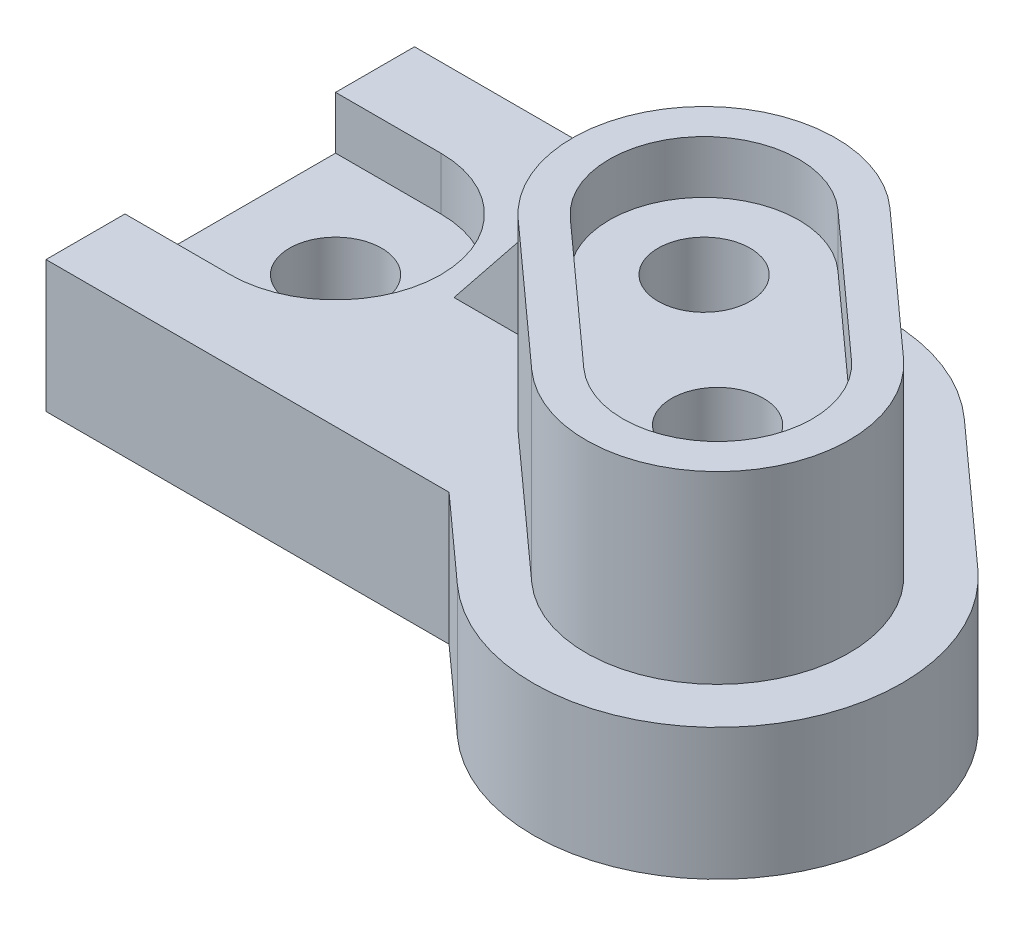
ISO-10303-21;
HEADER;
FILE_DESCRIPTION(('STEP AP214'),'2;1');
FILE_NAME('part.step','',(''),(''),'','','');
FILE_SCHEMA(('AUTOMOTIVE_DESIGN { 1 0 10303 214 1 1 1 1 }'));
ENDSEC;
DATA;
#1=APPLICATION_CONTEXT('core data for automotive mechanical design processes');
#2=APPLICATION_PROTOCOL_DEFINITION('international standard','automotive_design',2000,#1);
#3=PRODUCT_CONTEXT('',#1,'mechanical');
#4=PRODUCT('Part','Part','',(#3));
#5=PRODUCT_RELATED_PRODUCT_CATEGORY('part','',(#4));
#6=PRODUCT_DEFINITION_FORMATION('','',#4);
#7=PRODUCT_DEFINITION_CONTEXT('part definition',#1,'design');
#8=PRODUCT_DEFINITION('design','',#6,#7);
#9=PRODUCT_DEFINITION_SHAPE('','',#8);
#10=(LENGTH_UNIT() NAMED_UNIT(*) SI_UNIT(.MILLI.,.METRE.));
#11=(NAMED_UNIT(*) PLANE_ANGLE_UNIT() SI_UNIT($,.RADIAN.));
#12=(NAMED_UNIT(*) SI_UNIT($,.STERADIAN.) SOLID_ANGLE_UNIT());
#13=UNCERTAINTY_MEASURE_WITH_UNIT(LENGTH_MEASURE(1.E-05),#10,'distance_accuracy_value','');
#14=(GEOMETRIC_REPRESENTATION_CONTEXT(3) GLOBAL_UNCERTAINTY_ASSIGNED_CONTEXT((#13)) GLOBAL_UNIT_ASSIGNED_CONTEXT((#10,
#11,#12)) REPRESENTATION_CONTEXT('',''));
#15=CARTESIAN_POINT('',(0.,0.,0.));
#16=DIRECTION('',(0.,0.,1.));
#17=DIRECTION('',(1.,0.,0.));
#18=AXIS2_PLACEMENT_3D('',#15,#16,#17);
#19=CARTESIAN_POINT('',(0.,50.,-32.4999999999999));
#20=DIRECTION('',(0.,0.,-1.));
#21=DIRECTION('',(-1.,0.,0.));
#22=AXIS2_PLACEMENT_3D('',#19,#20,#21);
#23=PLANE('',#22);
#24=DIRECTION('',(0.,-1.,0.));
#25=VECTOR('',#24,1.);
#26=CARTESIAN_POINT('',(65.,50.,-32.4999999999999));
#27=LINE('',#26,#25);
#28=CARTESIAN_POINT('',(65.,50.,-32.4999999999999));
#29=VERTEX_POINT('',#28);
#30=CARTESIAN_POINT('',(65.,25.,-32.4999999999999));
#31=VERTEX_POINT('',#30);
#32=EDGE_CURVE('E89',#29,#31,#27,.T.);
#33=ORIENTED_EDGE('',*,*,#32,.F.);
#34=DIRECTION('',(0.624695047554424,0.78086880944303,0.));
#35=VECTOR('',#34,1.);
#36=CARTESIAN_POINT('',(45.,25.,-32.4999999999999));
#37=LINE('',#36,#35);
#38=CARTESIAN_POINT('',(45.,25.,-32.4999999999999));
#39=VERTEX_POINT('',#38);
#40=EDGE_CURVE('E14',#29,#39,#37,.F.);
#41=ORIENTED_EDGE('',*,*,#40,.T.);
#42=DIRECTION('',(1.,0.,0.));
#43=VECTOR('',#42,1.);
#44=CARTESIAN_POINT('',(0.,25.,-32.4999999999999));
#45=LINE('',#44,#43);
#46=EDGE_CURVE('E87',#39,#31,#45,.T.);
#47=ORIENTED_EDGE('',*,*,#46,.T.);
#48=EDGE_LOOP('',(#33,#41,#47));
#49=FACE_BOUND('',#48,.T.);
#50=ADVANCED_FACE('F53',(#49),#23,.F.);
#51=CARTESIAN_POINT('',(64.9999999999999,50.,1.80411241501588E-13));
#52=DIRECTION('',(-1.,0.,0.));
#53=DIRECTION('',(0.,0.,1.));
#54=AXIS2_PLACEMENT_3D('',#51,#52,#53);
#55=PLANE('',#54);
#56=DIRECTION('',(0.,0.,-1.));
#57=VECTOR('',#56,1.);
#58=CARTESIAN_POINT('',(64.9999999999999,25.,1.80411241501588E-13));
#59=LINE('',#58,#57);
#60=CARTESIAN_POINT('',(65.,25.,-37.4999999999999));
#61=VERTEX_POINT('',#60);
#62=EDGE_CURVE('E96',#31,#61,#59,.T.);
#63=ORIENTED_EDGE('',*,*,#62,.T.);
#64=DIRECTION('',(0.,-1.,0.));
#65=VECTOR('',#64,1.);
#66=CARTESIAN_POINT('',(65.,50.,-37.4999999999999));
#67=LINE('',#66,#65);
#68=CARTESIAN_POINT('',(65.,50.,-37.4999999999999));
#69=VERTEX_POINT('',#68);
#70=EDGE_CURVE('E101',#69,#61,#67,.T.);
#71=ORIENTED_EDGE('',*,*,#70,.F.);
#72=DIRECTION('',(0.,0.,-1.));
#73=VECTOR('',#72,1.);
#74=CARTESIAN_POINT('',(64.9999999999999,50.,1.80411241501588E-13));
#75=LINE('',#74,#73);
#76=EDGE_CURVE('E98',#29,#69,#75,.T.);
#77=ORIENTED_EDGE('',*,*,#76,.F.);
#78=ORIENTED_EDGE('',*,*,#32,.T.);
#79=EDGE_LOOP('',(#63,#71,#77,#78));
#80=FACE_BOUND('',#79,.T.);
#81=ADVANCED_FACE('F108',(#80),#55,.F.);
#82=CARTESIAN_POINT('',(0.,50.,-37.4999999999999));
#83=DIRECTION('',(0.,0.,-1.));
#84=DIRECTION('',(-1.,0.,0.));
#85=AXIS2_PLACEMENT_3D('',#82,#83,#84);
#86=PLANE('',#85);
#87=DIRECTION('',(1.,0.,0.));
#88=VECTOR('',#87,1.);
#89=CARTESIAN_POINT('',(0.,25.,-37.4999999999999));
#90=LINE('',#89,#88);
#91=CARTESIAN_POINT('',(45.,25.,-37.4999999999999));
#92=VERTEX_POINT('',#91);
#93=EDGE_CURVE('E99',#92,#61,#90,.T.);
#94=ORIENTED_EDGE('',*,*,#93,.F.);
#95=DIRECTION('',(-0.624695047554424,-0.78086880944303,0.));
#96=VECTOR('',#95,1.);
#97=CARTESIAN_POINT('',(39.6341463414634,18.2926829268293,-37.4999999999999));
#98=LINE('',#97,#96);
#99=EDGE_CURVE('E62',#92,#69,#98,.F.);
#100=ORIENTED_EDGE('',*,*,#99,.T.);
#101=ORIENTED_EDGE('',*,*,#70,.T.);
#102=EDGE_LOOP('',(#94,#100,#101));
#103=FACE_BOUND('',#102,.T.);
#104=ADVANCED_FACE('F109',(#103),#86,.T.);
#105=CARTESIAN_POINT('',(0.,25.,0.));
#106=DIRECTION('',(0.,1.,0.));
#107=DIRECTION('',(0.,0.,1.));
#108=AXIS2_PLACEMENT_3D('',#105,#106,#107);
#109=PLANE('',#108);
#110=ORIENTED_EDGE('',*,*,#46,.F.);
#111=DIRECTION('',(0.,0.,-1.));
#112=VECTOR('',#111,1.);
#113=CARTESIAN_POINT('',(45.,25.,0.));
#114=LINE('',#113,#112);
#115=EDGE_CURVE('E94',#39,#92,#114,.T.);
#116=ORIENTED_EDGE('',*,*,#115,.T.);
#117=ORIENTED_EDGE('',*,*,#93,.T.);
#118=ORIENTED_EDGE('',*,*,#62,.F.);
#119=EDGE_LOOP('',(#110,#116,#117,#118));
#120=FACE_BOUND('',#119,.T.);
#121=ADVANCED_FACE('F92',(#120),#109,.F.);
#122=CARTESIAN_POINT('',(45.,25.,0.));
#123=DIRECTION('',(0.78086880944303,-0.624695047554424,0.));
#124=DIRECTION('',(0.,0.,-1.));
#125=AXIS2_PLACEMENT_3D('',#122,#123,#124);
#126=PLANE('',#125);
#127=ORIENTED_EDGE('',*,*,#40,.F.);
#128=ORIENTED_EDGE('',*,*,#76,.T.);
#129=ORIENTED_EDGE('',*,*,#99,.F.);
#130=ORIENTED_EDGE('',*,*,#115,.F.);
#131=EDGE_LOOP('',(#127,#128,#129,#130));
#132=FACE_BOUND('',#131,.T.);
#133=ADVANCED_FACE('F55',(#132),#126,.F.);
#134=CLOSED_SHELL('',(#50,#81,#104,#121,#133));
#135=MANIFOLD_SOLID_BREP('B2',#134);
#136=CARTESIAN_POINT('',(20.,25.,-35.));
#137=DIRECTION('',(0.,1.,0.));
#138=DIRECTION('',(0.,0.,1.));
#139=AXIS2_PLACEMENT_3D('',#136,#137,#138);
#140=CYLINDRICAL_SURFACE('',#139,8.74999999999999);
#141=CARTESIAN_POINT('',(20.,0.,-35.));
#142=DIRECTION('',(0.,1.,0.));
#143=DIRECTION('',(0.,0.,1.));
#144=AXIS2_PLACEMENT_3D('',#141,#142,#143);
#145=CIRCLE('',#144,8.74999999999999);
#146=CARTESIAN_POINT('',(20.,0.,-26.25));
#147=VERTEX_POINT('',#146);
#148=EDGE_CURVE('E157',#147,#147,#145,.T.);
#149=ORIENTED_EDGE('',*,*,#148,.F.);
#150=EDGE_LOOP('',(#149));
#151=FACE_BOUND('',#150,.T.);
#152=CARTESIAN_POINT('',(20.,15.,-35.));
#153=DIRECTION('',(0.,1.,0.));
#154=DIRECTION('',(0.,0.,1.));
#155=AXIS2_PLACEMENT_3D('',#152,#153,#154);
#156=CIRCLE('',#155,8.74999999999999);
#157=CARTESIAN_POINT('',(20.,15.,-26.25));
#158=VERTEX_POINT('',#157);
#159=EDGE_CURVE('E304',#158,#158,#156,.F.);
#160=ORIENTED_EDGE('',*,*,#159,.F.);
#161=EDGE_LOOP('',(#160));
#162=FACE_BOUND('',#161,.T.);
#163=ADVANCED_FACE('F153',(#151,#162),#140,.F.);
#164=CARTESIAN_POINT('',(0.,25.,0.));
#165=DIRECTION('',(0.,1.,0.));
#166=DIRECTION('',(0.,0.,1.));
#167=AXIS2_PLACEMENT_3D('',#164,#165,#166);
#168=PLANE('',#167);
#169=DIRECTION('',(1.,0.,0.));
#170=VECTOR('',#169,1.);
#171=CARTESIAN_POINT('',(0.,25.,-15.));
#172=LINE('',#171,#170);
#173=CARTESIAN_POINT('',(0.,25.,-15.));
#174=VERTEX_POINT('',#173);
#175=CARTESIAN_POINT('',(20.,25.,-15.));
#176=VERTEX_POINT('',#175);
#177=EDGE_CURVE('E311',#174,#176,#172,.T.);
#178=ORIENTED_EDGE('',*,*,#177,.F.);
#179=DIRECTION('',(0.,0.,-1.));
#180=VECTOR('',#179,1.);
#181=CARTESIAN_POINT('',(0.,25.,0.));
#182=LINE('',#181,#180);
#183=CARTESIAN_POINT('',(0.,25.,0.));
#184=VERTEX_POINT('',#183);
#185=EDGE_CURVE('E407',#184,#174,#182,.T.);
#186=ORIENTED_EDGE('',*,*,#185,.F.);
#187=DIRECTION('',(1.,0.,0.));
#188=VECTOR('',#187,1.);
#189=CARTESIAN_POINT('',(0.,25.,0.));
#190=LINE('',#189,#188);
#191=CARTESIAN_POINT('',(76.556127607046,25.,0.));
#192=VERTEX_POINT('',#191);
#193=EDGE_CURVE('E410',#184,#192,#190,.T.);
#194=ORIENTED_EDGE('',*,*,#193,.T.);
#195=DIRECTION('',(0.742857142857143,0.,0.66944997222057));
#196=VECTOR('',#195,1.);
#197=CARTESIAN_POINT('',(34.3096441275659,25.,-38.0717981427467));
#198=LINE('',#197,#196);
#199=CARTESIAN_POINT('',(92.5692509722801,25.,14.43074902772));
#200=VERTEX_POINT('',#199);
#201=EDGE_CURVE('E412',#192,#200,#198,.T.);
#202=ORIENTED_EDGE('',*,*,#201,.T.);
#203=CARTESIAN_POINT('',(116.,25.,-11.56925097228));
#204=DIRECTION('',(0.,1.,0.));
#205=DIRECTION('',(0.,0.,1.));
#206=AXIS2_PLACEMENT_3D('',#203,#204,#205);
#207=CIRCLE('',#206,35.);
#208=CARTESIAN_POINT('',(139.43074902772,25.,-37.56925097228));
#209=VERTEX_POINT('',#208);
#210=EDGE_CURVE('E414',#200,#209,#207,.T.);
#211=ORIENTED_EDGE('',*,*,#210,.T.);
#212=DIRECTION('',(0.742857142857143,0.,0.66944997222057));
#213=VECTOR('',#212,1.);
#214=CARTESIAN_POINT('',(81.1711421830058,25.,-90.0717981427467));
#215=LINE('',#214,#213);
#216=CARTESIAN_POINT('',(113.43074902772,25.,-61.));
#217=VERTEX_POINT('',#216);
#218=EDGE_CURVE('E416',#217,#209,#215,.T.);
#219=ORIENTED_EDGE('',*,*,#218,.F.);
#220=CARTESIAN_POINT('',(90.,25.,-35.));
#221=DIRECTION('',(0.,1.,0.));
#222=DIRECTION('',(0.,0.,1.));
#223=AXIS2_PLACEMENT_3D('',#220,#221,#222);
#224=CIRCLE('',#223,35.);
#225=CARTESIAN_POINT('',(90.,25.,-70.));
#226=VERTEX_POINT('',#225);
#227=EDGE_CURVE('E400',#217,#226,#224,.T.);
#228=ORIENTED_EDGE('',*,*,#227,.T.);
#229=DIRECTION('',(1.,0.,0.));
#230=VECTOR('',#229,1.);
#231=CARTESIAN_POINT('',(0.,25.,-70.));
#232=LINE('',#231,#230);
#233=CARTESIAN_POINT('',(0.,25.,-70.));
#234=VERTEX_POINT('',#233);
#235=EDGE_CURVE('E402',#234,#226,#232,.T.);
#236=ORIENTED_EDGE('',*,*,#235,.F.);
#237=CARTESIAN_POINT('',(0.,25.,-55.));
#238=VERTEX_POINT('',#237);
#239=EDGE_CURVE('E406',#238,#234,#182,.T.);
#240=ORIENTED_EDGE('',*,*,#239,.F.);
#241=DIRECTION('',(1.,0.,0.));
#242=VECTOR('',#241,1.);
#243=CARTESIAN_POINT('',(0.,25.,-55.));
#244=LINE('',#243,#242);
#245=CARTESIAN_POINT('',(20.,25.,-55.));
#246=VERTEX_POINT('',#245);
#247=EDGE_CURVE('E314',#238,#246,#244,.T.);
#248=ORIENTED_EDGE('',*,*,#247,.T.);
#249=CARTESIAN_POINT('',(20.,25.,-35.));
#250=DIRECTION('',(0.,1.,0.));
#251=DIRECTION('',(0.,0.,1.));
#252=AXIS2_PLACEMENT_3D('',#249,#250,#251);
#253=CIRCLE('',#252,20.);
#254=EDGE_CURVE('E302',#246,#176,#253,.F.);
#255=ORIENTED_EDGE('',*,*,#254,.T.);
#256=EDGE_LOOP('',(#178,#186,#194,#202,#211,#219,#228,#236,#240,#248,#255));
#257=FACE_BOUND('',#256,.T.);
#258=DIRECTION('',(-0.742857142857143,0.,-0.669449972220571));
#259=VECTOR('',#258,1.);
#260=CARTESIAN_POINT('',(132.736249305514,25.,-30.1406795437086));
#261=LINE('',#260,#259);
#262=CARTESIAN_POINT('',(132.736249305514,25.,-30.1406795437086));
#263=VERTEX_POINT('',#262);
#264=CARTESIAN_POINT('',(106.736249305514,25.,-53.5714285714286));
#265=VERTEX_POINT('',#264);
#266=EDGE_CURVE('E384',#263,#265,#261,.T.);
#267=ORIENTED_EDGE('',*,*,#266,.F.);
#268=CARTESIAN_POINT('',(116.,25.,-11.56925097228));
#269=DIRECTION('',(0.,1.,0.));
#270=DIRECTION('',(0.,0.,1.));
#271=AXIS2_PLACEMENT_3D('',#268,#269,#270);
#272=CIRCLE('',#271,25.);
#273=CARTESIAN_POINT('',(99.2637506944858,25.,7.00217759914853));
#274=VERTEX_POINT('',#273);
#275=EDGE_CURVE('E365',#274,#263,#272,.T.);
#276=ORIENTED_EDGE('',*,*,#275,.F.);
#277=DIRECTION('',(0.742857142857143,0.,0.669449972220571));
#278=VECTOR('',#277,1.);
#279=CARTESIAN_POINT('',(99.2637506944858,25.,7.00217759914853));
#280=LINE('',#279,#278);
#281=CARTESIAN_POINT('',(73.2637506944857,25.,-16.4285714285715));
#282=VERTEX_POINT('',#281);
#283=EDGE_CURVE('E375',#282,#274,#280,.T.);
#284=ORIENTED_EDGE('',*,*,#283,.F.);
#285=CARTESIAN_POINT('',(90.,25.,-35.));
#286=DIRECTION('',(0.,1.,0.));
#287=DIRECTION('',(0.,0.,1.));
#288=AXIS2_PLACEMENT_3D('',#285,#286,#287);
#289=CIRCLE('',#288,25.);
#290=EDGE_CURVE('E386',#265,#282,#289,.T.);
#291=ORIENTED_EDGE('',*,*,#290,.F.);
#292=EDGE_LOOP('',(#267,#276,#284,#291));
#293=FACE_BOUND('',#292,.T.);
#294=ADVANCED_FACE('F476',(#257,#293),#168,.T.);
#295=CARTESIAN_POINT('',(90.,25.,-35.));
#296=DIRECTION('',(0.,-1.,0.));
#297=DIRECTION('',(0.,0.,-1.));
#298=AXIS2_PLACEMENT_3D('',#295,#296,#297);
#299=CYLINDRICAL_SURFACE('',#298,35.);
#300=CARTESIAN_POINT('',(90.,0.,-35.));
#301=DIRECTION('',(0.,1.,0.));
#302=DIRECTION('',(0.,0.,1.));
#303=AXIS2_PLACEMENT_3D('',#300,#301,#302);
#304=CIRCLE('',#303,35.);
#305=CARTESIAN_POINT('',(113.43074902772,0.,-61.));
#306=VERTEX_POINT('',#305);
#307=CARTESIAN_POINT('',(90.,0.,-70.));
#308=VERTEX_POINT('',#307);
#309=EDGE_CURVE('E399',#306,#308,#304,.T.);
#310=ORIENTED_EDGE('',*,*,#309,.T.);
#311=DIRECTION('',(0.,-1.,0.));
#312=VECTOR('',#311,1.);
#313=CARTESIAN_POINT('',(90.,25.,-70.));
#314=LINE('',#313,#312);
#315=EDGE_CURVE('E51',#226,#308,#314,.T.);
#316=ORIENTED_EDGE('',*,*,#315,.F.);
#317=ORIENTED_EDGE('',*,*,#227,.F.);
#318=DIRECTION('',(0.,-1.,0.));
#319=VECTOR('',#318,1.);
#320=CARTESIAN_POINT('',(113.43074902772,25.,-61.));
#321=LINE('',#320,#319);
#322=EDGE_CURVE('E419',#217,#306,#321,.T.);
#323=ORIENTED_EDGE('',*,*,#322,.T.);
#324=EDGE_LOOP('',(#310,#316,#317,#323));
#325=FACE_BOUND('',#324,.T.);
#326=ADVANCED_FACE('F155',(#325),#299,.T.);
#327=CARTESIAN_POINT('',(0.,25.,-70.));
#328=DIRECTION('',(0.,0.,-1.));
#329=DIRECTION('',(-1.,0.,0.));
#330=AXIS2_PLACEMENT_3D('',#327,#328,#329);
#331=PLANE('',#330);
#332=DIRECTION('',(1.,0.,0.));
#333=VECTOR('',#332,1.);
#334=CARTESIAN_POINT('',(0.,0.,-70.));
#335=LINE('',#334,#333);
#336=CARTESIAN_POINT('',(0.,0.,-70.));
#337=VERTEX_POINT('',#336);
#338=EDGE_CURVE('E422',#337,#308,#335,.T.);
#339=ORIENTED_EDGE('',*,*,#338,.F.);
#340=DIRECTION('',(0.,-1.,0.));
#341=VECTOR('',#340,1.);
#342=CARTESIAN_POINT('',(0.,25.,-70.));
#343=LINE('',#342,#341);
#344=EDGE_CURVE('E162',#234,#337,#343,.T.);
#345=ORIENTED_EDGE('',*,*,#344,.F.);
#346=ORIENTED_EDGE('',*,*,#235,.T.);
#347=ORIENTED_EDGE('',*,*,#315,.T.);
#348=EDGE_LOOP('',(#339,#345,#346,#347));
#349=FACE_BOUND('',#348,.T.);
#350=ADVANCED_FACE('F457',(#349),#331,.T.);
#351=CARTESIAN_POINT('',(0.,25.,0.));
#352=DIRECTION('',(-1.,0.,0.));
#353=DIRECTION('',(0.,0.,1.));
#354=AXIS2_PLACEMENT_3D('',#351,#352,#353);
#355=PLANE('',#354);
#356=DIRECTION('',(0.,1.,0.));
#357=VECTOR('',#356,1.);
#358=CARTESIAN_POINT('',(0.,15.,-15.));
#359=LINE('',#358,#357);
#360=CARTESIAN_POINT('',(0.,15.,-15.));
#361=VERTEX_POINT('',#360);
#362=EDGE_CURVE('E325',#361,#174,#359,.T.);
#363=ORIENTED_EDGE('',*,*,#362,.F.);
#364=DIRECTION('',(0.,0.,1.));
#365=VECTOR('',#364,1.);
#366=CARTESIAN_POINT('',(0.,15.,0.));
#367=LINE('',#366,#365);
#368=CARTESIAN_POINT('',(0.,15.,-55.));
#369=VERTEX_POINT('',#368);
#370=EDGE_CURVE('E295',#369,#361,#367,.T.);
#371=ORIENTED_EDGE('',*,*,#370,.F.);
#372=DIRECTION('',(0.,1.,0.));
#373=VECTOR('',#372,1.);
#374=CARTESIAN_POINT('',(0.,15.,-55.));
#375=LINE('',#374,#373);
#376=EDGE_CURVE('E293',#369,#238,#375,.T.);
#377=ORIENTED_EDGE('',*,*,#376,.T.);
#378=ORIENTED_EDGE('',*,*,#239,.T.);
#379=ORIENTED_EDGE('',*,*,#344,.T.);
#380=DIRECTION('',(0.,0.,-1.));
#381=VECTOR('',#380,1.);
#382=CARTESIAN_POINT('',(0.,0.,0.));
#383=LINE('',#382,#381);
#384=CARTESIAN_POINT('',(0.,0.,0.));
#385=VERTEX_POINT('',#384);
#386=EDGE_CURVE('E425',#385,#337,#383,.T.);
#387=ORIENTED_EDGE('',*,*,#386,.F.);
#388=DIRECTION('',(0.,-1.,0.));
#389=VECTOR('',#388,1.);
#390=CARTESIAN_POINT('',(0.,25.,0.));
#391=LINE('',#390,#389);
#392=EDGE_CURVE('E446',#184,#385,#391,.T.);
#393=ORIENTED_EDGE('',*,*,#392,.F.);
#394=ORIENTED_EDGE('',*,*,#185,.T.);
#395=EDGE_LOOP('',(#363,#371,#377,#378,#379,#387,#393,#394));
#396=FACE_BOUND('',#395,.T.);
#397=ADVANCED_FACE('F453',(#396),#355,.T.);
#398=CARTESIAN_POINT('',(0.,25.,0.));
#399=DIRECTION('',(0.,0.,-1.));
#400=DIRECTION('',(-1.,0.,0.));
#401=AXIS2_PLACEMENT_3D('',#398,#399,#400);
#402=PLANE('',#401);
#403=DIRECTION('',(1.,0.,0.));
#404=VECTOR('',#403,1.);
#405=CARTESIAN_POINT('',(0.,0.,0.));
#406=LINE('',#405,#404);
#407=CARTESIAN_POINT('',(76.556127607046,0.,0.));
#408=VERTEX_POINT('',#407);
#409=EDGE_CURVE('E428',#385,#408,#406,.T.);
#410=ORIENTED_EDGE('',*,*,#409,.T.);
#411=DIRECTION('',(0.,-1.,0.));
#412=VECTOR('',#411,1.);
#413=CARTESIAN_POINT('',(76.556127607046,25.,0.));
#414=LINE('',#413,#412);
#415=EDGE_CURVE('E443',#192,#408,#414,.T.);
#416=ORIENTED_EDGE('',*,*,#415,.F.);
#417=ORIENTED_EDGE('',*,*,#193,.F.);
#418=ORIENTED_EDGE('',*,*,#392,.T.);
#419=EDGE_LOOP('',(#410,#416,#417,#418));
#420=FACE_BOUND('',#419,.T.);
#421=ADVANCED_FACE('F467',(#420),#402,.F.);
#422=CARTESIAN_POINT('',(34.3096441275659,25.,-38.0717981427467));
#423=DIRECTION('',(0.66944997222057,0.,-0.742857142857143));
#424=DIRECTION('',(-0.742857142857143,0.,-0.66944997222057));
#425=AXIS2_PLACEMENT_3D('',#422,#423,#424);
#426=PLANE('',#425);
#427=DIRECTION('',(0.742857142857143,0.,0.66944997222057));
#428=VECTOR('',#427,1.);
#429=CARTESIAN_POINT('',(34.3096441275659,0.,-38.0717981427467));
#430=LINE('',#429,#428);
#431=CARTESIAN_POINT('',(92.5692509722801,0.,14.43074902772));
#432=VERTEX_POINT('',#431);
#433=EDGE_CURVE('E430',#408,#432,#430,.T.);
#434=ORIENTED_EDGE('',*,*,#433,.T.);
#435=DIRECTION('',(0.,-1.,0.));
#436=VECTOR('',#435,1.);
#437=CARTESIAN_POINT('',(92.5692509722801,25.,14.43074902772));
#438=LINE('',#437,#436);
#439=EDGE_CURVE('E440',#200,#432,#438,.T.);
#440=ORIENTED_EDGE('',*,*,#439,.F.);
#441=ORIENTED_EDGE('',*,*,#201,.F.);
#442=ORIENTED_EDGE('',*,*,#415,.T.);
#443=EDGE_LOOP('',(#434,#440,#441,#442));
#444=FACE_BOUND('',#443,.T.);
#445=ADVANCED_FACE('F471',(#444),#426,.F.);
#446=CARTESIAN_POINT('',(116.,25.,-11.56925097228));
#447=DIRECTION('',(0.,-1.,0.));
#448=DIRECTION('',(0.,0.,-1.));
#449=AXIS2_PLACEMENT_3D('',#446,#447,#448);
#450=CYLINDRICAL_SURFACE('',#449,35.);
#451=CARTESIAN_POINT('',(116.,0.,-11.56925097228));
#452=DIRECTION('',(0.,1.,0.));
#453=DIRECTION('',(0.,0.,1.));
#454=AXIS2_PLACEMENT_3D('',#451,#452,#453);
#455=CIRCLE('',#454,35.);
#456=CARTESIAN_POINT('',(139.43074902772,0.,-37.56925097228));
#457=VERTEX_POINT('',#456);
#458=EDGE_CURVE('E432',#432,#457,#455,.T.);
#459=ORIENTED_EDGE('',*,*,#458,.T.);
#460=DIRECTION('',(0.,-1.,0.));
#461=VECTOR('',#460,1.);
#462=CARTESIAN_POINT('',(139.43074902772,25.,-37.56925097228));
#463=LINE('',#462,#461);
#464=EDGE_CURVE('E438',#209,#457,#463,.T.);
#465=ORIENTED_EDGE('',*,*,#464,.F.);
#466=ORIENTED_EDGE('',*,*,#210,.F.);
#467=ORIENTED_EDGE('',*,*,#439,.T.);
#468=EDGE_LOOP('',(#459,#465,#466,#467));
#469=FACE_BOUND('',#468,.T.);
#470=ADVANCED_FACE('F489',(#469),#450,.T.);
#471=CARTESIAN_POINT('',(81.1711421830058,25.,-90.0717981427467));
#472=DIRECTION('',(0.66944997222057,0.,-0.742857142857143));
#473=DIRECTION('',(-0.742857142857143,0.,-0.66944997222057));
#474=AXIS2_PLACEMENT_3D('',#471,#472,#473);
#475=PLANE('',#474);
#476=DIRECTION('',(0.742857142857143,0.,0.66944997222057));
#477=VECTOR('',#476,1.);
#478=CARTESIAN_POINT('',(81.1711421830058,0.,-90.0717981427467));
#479=LINE('',#478,#477);
#480=EDGE_CURVE('E403',#306,#457,#479,.T.);
#481=ORIENTED_EDGE('',*,*,#480,.F.);
#482=ORIENTED_EDGE('',*,*,#322,.F.);
#483=ORIENTED_EDGE('',*,*,#218,.T.);
#484=ORIENTED_EDGE('',*,*,#464,.T.);
#485=EDGE_LOOP('',(#481,#482,#483,#484));
#486=FACE_BOUND('',#485,.T.);
#487=ADVANCED_FACE('F487',(#486),#475,.T.);
#488=CARTESIAN_POINT('',(0.,0.,0.));
#489=DIRECTION('',(0.,1.,0.));
#490=DIRECTION('',(0.,0.,1.));
#491=AXIS2_PLACEMENT_3D('',#488,#489,#490);
#492=PLANE('',#491);
#493=ORIENTED_EDGE('',*,*,#148,.T.);
#494=EDGE_LOOP('',(#493));
#495=FACE_BOUND('',#494,.T.);
#496=ORIENTED_EDGE('',*,*,#309,.F.);
#497=ORIENTED_EDGE('',*,*,#480,.T.);
#498=ORIENTED_EDGE('',*,*,#458,.F.);
#499=ORIENTED_EDGE('',*,*,#433,.F.);
#500=ORIENTED_EDGE('',*,*,#409,.F.);
#501=ORIENTED_EDGE('',*,*,#386,.T.);
#502=ORIENTED_EDGE('',*,*,#338,.T.);
#503=EDGE_LOOP('',(#496,#497,#498,#499,#500,#501,#502));
#504=FACE_BOUND('',#503,.T.);
#505=ADVANCED_FACE('F462',(#495,#504),#492,.F.);
#506=CARTESIAN_POINT('',(116.,60.,-11.56925097228));
#507=DIRECTION('',(0.,-1.,0.));
#508=DIRECTION('',(0.,0.,-1.));
#509=AXIS2_PLACEMENT_3D('',#506,#507,#508);
#510=CYLINDRICAL_SURFACE('',#509,25.);
#511=ORIENTED_EDGE('',*,*,#275,.T.);
#512=DIRECTION('',(0.,-1.,0.));
#513=VECTOR('',#512,1.);
#514=CARTESIAN_POINT('',(132.736249305514,60.,-30.1406795437086));
#515=LINE('',#514,#513);
#516=CARTESIAN_POINT('',(132.736249305514,60.,-30.1406795437086));
#517=VERTEX_POINT('',#516);
#518=EDGE_CURVE('E397',#517,#263,#515,.T.);
#519=ORIENTED_EDGE('',*,*,#518,.F.);
#520=CARTESIAN_POINT('',(116.,60.,-11.56925097228));
#521=DIRECTION('',(0.,1.,0.));
#522=DIRECTION('',(0.,0.,1.));
#523=AXIS2_PLACEMENT_3D('',#520,#521,#522);
#524=CIRCLE('',#523,25.);
#525=CARTESIAN_POINT('',(99.2637506944858,60.,7.00217759914853));
#526=VERTEX_POINT('',#525);
#527=EDGE_CURVE('E371',#526,#517,#524,.T.);
#528=ORIENTED_EDGE('',*,*,#527,.F.);
#529=DIRECTION('',(0.,-1.,0.));
#530=VECTOR('',#529,1.);
#531=CARTESIAN_POINT('',(99.2637506944858,60.,7.00217759914853));
#532=LINE('',#531,#530);
#533=EDGE_CURVE('E381',#526,#274,#532,.T.);
#534=ORIENTED_EDGE('',*,*,#533,.T.);
#535=EDGE_LOOP('',(#511,#519,#528,#534));
#536=FACE_BOUND('',#535,.T.);
#537=ADVANCED_FACE('F560',(#536),#510,.T.);
#538=CARTESIAN_POINT('',(132.736249305514,60.,-30.1406795437086));
#539=DIRECTION('',(-0.669449972220571,0.,0.742857142857143));
#540=DIRECTION('',(0.742857142857143,0.,0.669449972220571));
#541=AXIS2_PLACEMENT_3D('',#538,#539,#540);
#542=PLANE('',#541);
#543=ORIENTED_EDGE('',*,*,#266,.T.);
#544=DIRECTION('',(0.,-1.,0.));
#545=VECTOR('',#544,1.);
#546=CARTESIAN_POINT('',(106.736249305514,60.,-53.5714285714286));
#547=LINE('',#546,#545);
#548=CARTESIAN_POINT('',(106.736249305514,60.,-53.5714285714286));
#549=VERTEX_POINT('',#548);
#550=EDGE_CURVE('E394',#549,#265,#547,.T.);
#551=ORIENTED_EDGE('',*,*,#550,.F.);
#552=DIRECTION('',(-0.742857142857143,0.,-0.669449972220571));
#553=VECTOR('',#552,1.);
#554=CARTESIAN_POINT('',(132.736249305514,60.,-30.1406795437086));
#555=LINE('',#554,#553);
#556=EDGE_CURVE('E374',#517,#549,#555,.T.);
#557=ORIENTED_EDGE('',*,*,#556,.F.);
#558=ORIENTED_EDGE('',*,*,#518,.T.);
#559=EDGE_LOOP('',(#543,#551,#557,#558));
#560=FACE_BOUND('',#559,.T.);
#561=ADVANCED_FACE('F556',(#560),#542,.F.);
#562=CARTESIAN_POINT('',(90.,60.,-35.));
#563=DIRECTION('',(0.,-1.,0.));
#564=DIRECTION('',(0.,0.,-1.));
#565=AXIS2_PLACEMENT_3D('',#562,#563,#564);
#566=CYLINDRICAL_SURFACE('',#565,25.);
#567=ORIENTED_EDGE('',*,*,#290,.T.);
#568=DIRECTION('',(0.,-1.,0.));
#569=VECTOR('',#568,1.);
#570=CARTESIAN_POINT('',(73.2637506944857,60.,-16.4285714285714));
#571=LINE('',#570,#569);
#572=CARTESIAN_POINT('',(73.2637506944857,60.,-16.4285714285714));
#573=VERTEX_POINT('',#572);
#574=EDGE_CURVE('E392',#573,#282,#571,.T.);
#575=ORIENTED_EDGE('',*,*,#574,.F.);
#576=CARTESIAN_POINT('',(90.,60.,-35.));
#577=DIRECTION('',(0.,1.,0.));
#578=DIRECTION('',(0.,0.,1.));
#579=AXIS2_PLACEMENT_3D('',#576,#577,#578);
#580=CIRCLE('',#579,25.);
#581=EDGE_CURVE('E377',#549,#573,#580,.T.);
#582=ORIENTED_EDGE('',*,*,#581,.F.);
#583=ORIENTED_EDGE('',*,*,#550,.T.);
#584=EDGE_LOOP('',(#567,#575,#582,#583));
#585=FACE_BOUND('',#584,.T.);
#586=ADVANCED_FACE('F552',(#585),#566,.T.);
#587=CARTESIAN_POINT('',(99.2637506944858,60.,7.00217759914853));
#588=DIRECTION('',(0.669449972220571,0.,-0.742857142857143));
#589=DIRECTION('',(-0.742857142857143,0.,-0.669449972220571));
#590=AXIS2_PLACEMENT_3D('',#587,#588,#589);
#591=PLANE('',#590);
#592=ORIENTED_EDGE('',*,*,#283,.T.);
#593=ORIENTED_EDGE('',*,*,#533,.F.);
#594=DIRECTION('',(0.742857142857143,0.,0.669449972220571));
#595=VECTOR('',#594,1.);
#596=CARTESIAN_POINT('',(99.2637506944858,60.,7.00217759914853));
#597=LINE('',#596,#595);
#598=EDGE_CURVE('E379',#573,#526,#597,.T.);
#599=ORIENTED_EDGE('',*,*,#598,.F.);
#600=ORIENTED_EDGE('',*,*,#574,.T.);
#601=EDGE_LOOP('',(#592,#593,#599,#600));
#602=FACE_BOUND('',#601,.T.);
#603=ADVANCED_FACE('F548',(#602),#591,.F.);
#604=CARTESIAN_POINT('',(116.,60.,-11.56925097228));
#605=DIRECTION('',(0.,1.,0.));
#606=DIRECTION('',(0.,0.,1.));
#607=AXIS2_PLACEMENT_3D('',#604,#605,#606);
#608=PLANE('',#607);
#609=CARTESIAN_POINT('',(116.,60.,-11.56925097228));
#610=DIRECTION('',(0.,1.,0.));
#611=DIRECTION('',(0.,0.,1.));
#612=AXIS2_PLACEMENT_3D('',#609,#610,#611);
#613=CIRCLE('',#612,18.);
#614=CARTESIAN_POINT('',(103.94990050003,60.,1.80217759914853));
#615=VERTEX_POINT('',#614);
#616=CARTESIAN_POINT('',(128.05009949997,60.,-24.9406795437086));
#617=VERTEX_POINT('',#616);
#618=EDGE_CURVE('E177',#615,#617,#613,.T.);
#619=ORIENTED_EDGE('',*,*,#618,.F.);
#620=DIRECTION('',(0.742857142857143,0.,0.66944997222057));
#621=VECTOR('',#620,1.);
#622=CARTESIAN_POINT('',(103.94990050003,60.,1.80217759914853));
#623=LINE('',#622,#621);
#624=CARTESIAN_POINT('',(77.9499005000297,60.,-21.6285714285714));
#625=VERTEX_POINT('',#624);
#626=EDGE_CURVE('E344',#625,#615,#623,.T.);
#627=ORIENTED_EDGE('',*,*,#626,.F.);
#628=CARTESIAN_POINT('',(90.,60.,-35.));
#629=DIRECTION('',(0.,1.,0.));
#630=DIRECTION('',(0.,0.,1.));
#631=AXIS2_PLACEMENT_3D('',#628,#629,#630);
#632=CIRCLE('',#631,18.);
#633=CARTESIAN_POINT('',(102.05009949997,60.,-48.3714285714286));
#634=VERTEX_POINT('',#633);
#635=EDGE_CURVE('E358',#634,#625,#632,.T.);
#636=ORIENTED_EDGE('',*,*,#635,.F.);
#637=DIRECTION('',(-0.742857142857143,0.,-0.66944997222057));
#638=VECTOR('',#637,1.);
#639=CARTESIAN_POINT('',(128.05009949997,60.,-24.9406795437086));
#640=LINE('',#639,#638);
#641=EDGE_CURVE('E355',#617,#634,#640,.T.);
#642=ORIENTED_EDGE('',*,*,#641,.F.);
#643=EDGE_LOOP('',(#619,#627,#636,#642));
#644=FACE_BOUND('',#643,.T.);
#645=ORIENTED_EDGE('',*,*,#527,.T.);
#646=ORIENTED_EDGE('',*,*,#556,.T.);
#647=ORIENTED_EDGE('',*,*,#581,.T.);
#648=ORIENTED_EDGE('',*,*,#598,.T.);
#649=EDGE_LOOP('',(#645,#646,#647,#648));
#650=FACE_BOUND('',#649,.T.);
#651=ADVANCED_FACE('F545',(#644,#650),#608,.T.);
#652=CARTESIAN_POINT('',(116.,50.,-11.56925097228));
#653=DIRECTION('',(0.,1.,0.));
#654=DIRECTION('',(0.,0.,1.));
#655=AXIS2_PLACEMENT_3D('',#652,#653,#654);
#656=CYLINDRICAL_SURFACE('',#655,18.);
#657=ORIENTED_EDGE('',*,*,#618,.T.);
#658=DIRECTION('',(0.,1.,0.));
#659=VECTOR('',#658,1.);
#660=CARTESIAN_POINT('',(128.05009949997,50.,-24.9406795437086));
#661=LINE('',#660,#659);
#662=CARTESIAN_POINT('',(128.05009949997,50.,-24.9406795437086));
#663=VERTEX_POINT('',#662);
#664=EDGE_CURVE('E353',#663,#617,#661,.T.);
#665=ORIENTED_EDGE('',*,*,#664,.F.);
#666=CARTESIAN_POINT('',(116.,50.,-11.56925097228));
#667=DIRECTION('',(0.,1.,0.));
#668=DIRECTION('',(0.,0.,1.));
#669=AXIS2_PLACEMENT_3D('',#666,#667,#668);
#670=CIRCLE('',#669,18.);
#671=CARTESIAN_POINT('',(103.94990050003,50.,1.80217759914853));
#672=VERTEX_POINT('',#671);
#673=EDGE_CURVE('E340',#672,#663,#670,.T.);
#674=ORIENTED_EDGE('',*,*,#673,.F.);
#675=DIRECTION('',(0.,1.,0.));
#676=VECTOR('',#675,1.);
#677=CARTESIAN_POINT('',(103.94990050003,50.,1.80217759914853));
#678=LINE('',#677,#676);
#679=EDGE_CURVE('E363',#672,#615,#678,.T.);
#680=ORIENTED_EDGE('',*,*,#679,.T.);
#681=EDGE_LOOP('',(#657,#665,#674,#680));
#682=FACE_BOUND('',#681,.T.);
#683=ADVANCED_FACE('F535',(#682),#656,.F.);
#684=CARTESIAN_POINT('',(103.94990050003,50.,1.80217759914853));
#685=DIRECTION('',(-0.66944997222057,0.,0.742857142857143));
#686=DIRECTION('',(0.742857142857143,0.,0.66944997222057));
#687=AXIS2_PLACEMENT_3D('',#684,#685,#686);
#688=PLANE('',#687);
#689=ORIENTED_EDGE('',*,*,#626,.T.);
#690=ORIENTED_EDGE('',*,*,#679,.F.);
#691=DIRECTION('',(0.742857142857143,0.,0.66944997222057));
#692=VECTOR('',#691,1.);
#693=CARTESIAN_POINT('',(103.94990050003,50.,1.80217759914853));
#694=LINE('',#693,#692);
#695=CARTESIAN_POINT('',(77.9499005000297,50.,-21.6285714285714));
#696=VERTEX_POINT('',#695);
#697=EDGE_CURVE('E350',#696,#672,#694,.T.);
#698=ORIENTED_EDGE('',*,*,#697,.F.);
#699=DIRECTION('',(0.,1.,0.));
#700=VECTOR('',#699,1.);
#701=CARTESIAN_POINT('',(77.9499005000297,50.,-21.6285714285714));
#702=LINE('',#701,#700);
#703=EDGE_CURVE('E366',#696,#625,#702,.T.);
#704=ORIENTED_EDGE('',*,*,#703,.T.);
#705=EDGE_LOOP('',(#689,#690,#698,#704));
#706=FACE_BOUND('',#705,.T.);
#707=ADVANCED_FACE('F531',(#706),#688,.F.);
#708=CARTESIAN_POINT('',(90.,50.,-35.));
#709=DIRECTION('',(0.,1.,0.));
#710=DIRECTION('',(0.,0.,1.));
#711=AXIS2_PLACEMENT_3D('',#708,#709,#710);
#712=CYLINDRICAL_SURFACE('',#711,18.);
#713=ORIENTED_EDGE('',*,*,#635,.T.);
#714=ORIENTED_EDGE('',*,*,#703,.F.);
#715=CARTESIAN_POINT('',(90.,50.,-35.));
#716=DIRECTION('',(0.,1.,0.));
#717=DIRECTION('',(0.,0.,1.));
#718=AXIS2_PLACEMENT_3D('',#715,#716,#717);
#719=CIRCLE('',#718,18.);
#720=CARTESIAN_POINT('',(102.05009949997,50.,-48.3714285714286));
#721=VERTEX_POINT('',#720);
#722=EDGE_CURVE('E347',#721,#696,#719,.T.);
#723=ORIENTED_EDGE('',*,*,#722,.F.);
#724=DIRECTION('',(0.,1.,0.));
#725=VECTOR('',#724,1.);
#726=CARTESIAN_POINT('',(102.05009949997,50.,-48.3714285714286));
#727=LINE('',#726,#725);
#728=EDGE_CURVE('E368',#721,#634,#727,.T.);
#729=ORIENTED_EDGE('',*,*,#728,.T.);
#730=EDGE_LOOP('',(#713,#714,#723,#729));
#731=FACE_BOUND('',#730,.T.);
#732=ADVANCED_FACE('F534',(#731),#712,.F.);
#733=CARTESIAN_POINT('',(128.05009949997,50.,-24.9406795437086));
#734=DIRECTION('',(0.66944997222057,0.,-0.742857142857143));
#735=DIRECTION('',(-0.742857142857143,0.,-0.66944997222057));
#736=AXIS2_PLACEMENT_3D('',#733,#734,#735);
#737=PLANE('',#736);
#738=ORIENTED_EDGE('',*,*,#641,.T.);
#739=ORIENTED_EDGE('',*,*,#728,.F.);
#740=DIRECTION('',(-0.742857142857143,0.,-0.66944997222057));
#741=VECTOR('',#740,1.);
#742=CARTESIAN_POINT('',(128.05009949997,50.,-24.9406795437086));
#743=LINE('',#742,#741);
#744=EDGE_CURVE('E343',#663,#721,#743,.T.);
#745=ORIENTED_EDGE('',*,*,#744,.F.);
#746=ORIENTED_EDGE('',*,*,#664,.T.);
#747=EDGE_LOOP('',(#738,#739,#745,#746));
#748=FACE_BOUND('',#747,.T.);
#749=ADVANCED_FACE('F529',(#748),#737,.F.);
#750=CARTESIAN_POINT('',(116.,50.,-11.56925097228));
#751=DIRECTION('',(0.,1.,0.));
#752=DIRECTION('',(0.,0.,1.));
#753=AXIS2_PLACEMENT_3D('',#750,#751,#752);
#754=PLANE('',#753);
#755=CARTESIAN_POINT('',(90.,50.,-35.));
#756=DIRECTION('',(0.,1.,0.));
#757=DIRECTION('',(0.,0.,1.));
#758=AXIS2_PLACEMENT_3D('',#755,#756,#757);
#759=CIRCLE('',#758,8.74999999999999);
#760=CARTESIAN_POINT('',(90.,50.,-26.25));
#761=VERTEX_POINT('',#760);
#762=EDGE_CURVE('E328',#761,#761,#759,.T.);
#763=ORIENTED_EDGE('',*,*,#762,.F.);
#764=EDGE_LOOP('',(#763));
#765=FACE_BOUND('',#764,.T.);
#766=CARTESIAN_POINT('',(116.,50.,-11.56925097228));
#767=DIRECTION('',(0.,1.,0.));
#768=DIRECTION('',(0.,0.,1.));
#769=AXIS2_PLACEMENT_3D('',#766,#767,#768);
#770=CIRCLE('',#769,8.74999999999999);
#771=CARTESIAN_POINT('',(116.,50.,-2.81925097228004));
#772=VERTEX_POINT('',#771);
#773=EDGE_CURVE('E334',#772,#772,#770,.T.);
#774=ORIENTED_EDGE('',*,*,#773,.F.);
#775=EDGE_LOOP('',(#774));
#776=FACE_BOUND('',#775,.T.);
#777=ORIENTED_EDGE('',*,*,#673,.T.);
#778=ORIENTED_EDGE('',*,*,#744,.T.);
#779=ORIENTED_EDGE('',*,*,#722,.T.);
#780=ORIENTED_EDGE('',*,*,#697,.T.);
#781=EDGE_LOOP('',(#777,#778,#779,#780));
#782=FACE_BOUND('',#781,.T.);
#783=ADVANCED_FACE('F525',(#765,#776,#782),#754,.T.);
#784=CARTESIAN_POINT('',(116.,30.,-11.56925097228));
#785=DIRECTION('',(0.,1.,0.));
#786=DIRECTION('',(0.,0.,1.));
#787=AXIS2_PLACEMENT_3D('',#784,#785,#786);
#788=CONICAL_SURFACE('',#787,8.74999999999999,1.02974425867665);
#789=CARTESIAN_POINT('',(116.,24.7424695835088,-11.56925097228));
#790=VERTEX_POINT('',#789);
#791=VERTEX_LOOP('',#790);
#792=FACE_BOUND('',#791,.T.);
#793=CARTESIAN_POINT('',(116.,30.,-11.56925097228));
#794=DIRECTION('',(0.,1.,0.));
#795=DIRECTION('',(0.,0.,1.));
#796=AXIS2_PLACEMENT_3D('',#793,#794,#795);
#797=CIRCLE('',#796,8.74999999999999);
#798=CARTESIAN_POINT('',(116.,30.,-2.81925097228004));
#799=VERTEX_POINT('',#798);
#800=EDGE_CURVE('E337',#799,#799,#797,.T.);
#801=ORIENTED_EDGE('',*,*,#800,.T.);
#802=EDGE_LOOP('',(#801));
#803=FACE_BOUND('',#802,.T.);
#804=ADVANCED_FACE('F521',(#792,#803),#788,.F.);
#805=CARTESIAN_POINT('',(116.,50.,-11.56925097228));
#806=DIRECTION('',(0.,1.,0.));
#807=DIRECTION('',(0.,0.,1.));
#808=AXIS2_PLACEMENT_3D('',#805,#806,#807);
#809=CYLINDRICAL_SURFACE('',#808,8.74999999999999);
#810=ORIENTED_EDGE('',*,*,#800,.F.);
#811=EDGE_LOOP('',(#810));
#812=FACE_BOUND('',#811,.T.);
#813=ORIENTED_EDGE('',*,*,#773,.T.);
#814=EDGE_LOOP('',(#813));
#815=FACE_BOUND('',#814,.T.);
#816=ADVANCED_FACE('F517',(#812,#815),#809,.F.);
#817=CARTESIAN_POINT('',(90.,30.,-35.));
#818=DIRECTION('',(0.,1.,0.));
#819=DIRECTION('',(0.,0.,1.));
#820=AXIS2_PLACEMENT_3D('',#817,#818,#819);
#821=CONICAL_SURFACE('',#820,8.74999999999999,1.02974425867665);
#822=CARTESIAN_POINT('',(90.,24.7424695835088,-35.));
#823=VERTEX_POINT('',#822);
#824=VERTEX_LOOP('',#823);
#825=FACE_BOUND('',#824,.T.);
#826=CARTESIAN_POINT('',(90.,30.,-35.));
#827=DIRECTION('',(0.,1.,0.));
#828=DIRECTION('',(0.,0.,1.));
#829=AXIS2_PLACEMENT_3D('',#826,#827,#828);
#830=CIRCLE('',#829,8.74999999999999);
#831=CARTESIAN_POINT('',(90.,30.,-26.25));
#832=VERTEX_POINT('',#831);
#833=EDGE_CURVE('E331',#832,#832,#830,.T.);
#834=ORIENTED_EDGE('',*,*,#833,.T.);
#835=EDGE_LOOP('',(#834));
#836=FACE_BOUND('',#835,.T.);
#837=ADVANCED_FACE('F513',(#825,#836),#821,.F.);
#838=CARTESIAN_POINT('',(90.,50.,-35.));
#839=DIRECTION('',(0.,1.,0.));
#840=DIRECTION('',(0.,0.,1.));
#841=AXIS2_PLACEMENT_3D('',#838,#839,#840);
#842=CYLINDRICAL_SURFACE('',#841,8.74999999999999);
#843=ORIENTED_EDGE('',*,*,#833,.F.);
#844=EDGE_LOOP('',(#843));
#845=FACE_BOUND('',#844,.T.);
#846=ORIENTED_EDGE('',*,*,#762,.T.);
#847=EDGE_LOOP('',(#846));
#848=FACE_BOUND('',#847,.T.);
#849=ADVANCED_FACE('F510',(#845,#848),#842,.F.);
#850=CARTESIAN_POINT('',(20.,15.,-35.));
#851=DIRECTION('',(0.,1.,0.));
#852=DIRECTION('',(0.,0.,1.));
#853=AXIS2_PLACEMENT_3D('',#850,#851,#852);
#854=CYLINDRICAL_SURFACE('',#853,20.);
#855=ORIENTED_EDGE('',*,*,#254,.F.);
#856=DIRECTION('',(0.,1.,0.));
#857=VECTOR('',#856,1.);
#858=CARTESIAN_POINT('',(20.,15.,-55.));
#859=LINE('',#858,#857);
#860=CARTESIAN_POINT('',(20.,15.,-55.));
#861=VERTEX_POINT('',#860);
#862=EDGE_CURVE('E290',#861,#246,#859,.T.);
#863=ORIENTED_EDGE('',*,*,#862,.F.);
#864=CARTESIAN_POINT('',(20.,15.,-35.));
#865=DIRECTION('',(0.,1.,0.));
#866=DIRECTION('',(0.,0.,1.));
#867=AXIS2_PLACEMENT_3D('',#864,#865,#866);
#868=CIRCLE('',#867,20.);
#869=CARTESIAN_POINT('',(20.,15.,-15.));
#870=VERTEX_POINT('',#869);
#871=EDGE_CURVE('E296',#861,#870,#868,.F.);
#872=ORIENTED_EDGE('',*,*,#871,.T.);
#873=DIRECTION('',(0.,1.,0.));
#874=VECTOR('',#873,1.);
#875=CARTESIAN_POINT('',(20.,15.,-15.));
#876=LINE('',#875,#874);
#877=EDGE_CURVE('E323',#870,#176,#876,.T.);
#878=ORIENTED_EDGE('',*,*,#877,.T.);
#879=EDGE_LOOP('',(#855,#863,#872,#878));
#880=FACE_BOUND('',#879,.T.);
#881=ADVANCED_FACE('F299',(#880),#854,.F.);
#882=CARTESIAN_POINT('',(0.,15.,-15.));
#883=DIRECTION('',(0.,0.,1.));
#884=DIRECTION('',(1.,0.,0.));
#885=AXIS2_PLACEMENT_3D('',#882,#883,#884);
#886=PLANE('',#885);
#887=ORIENTED_EDGE('',*,*,#177,.T.);
#888=ORIENTED_EDGE('',*,*,#877,.F.);
#889=DIRECTION('',(1.,0.,0.));
#890=VECTOR('',#889,1.);
#891=CARTESIAN_POINT('',(0.,15.,-15.));
#892=LINE('',#891,#890);
#893=EDGE_CURVE('E310',#361,#870,#892,.T.);
#894=ORIENTED_EDGE('',*,*,#893,.F.);
#895=ORIENTED_EDGE('',*,*,#362,.T.);
#896=EDGE_LOOP('',(#887,#888,#894,#895));
#897=FACE_BOUND('',#896,.T.);
#898=ADVANCED_FACE('F482',(#897),#886,.F.);
#899=CARTESIAN_POINT('',(0.,15.,-55.));
#900=DIRECTION('',(0.,0.,1.));
#901=DIRECTION('',(1.,0.,0.));
#902=AXIS2_PLACEMENT_3D('',#899,#900,#901);
#903=PLANE('',#902);
#904=ORIENTED_EDGE('',*,*,#247,.F.);
#905=ORIENTED_EDGE('',*,*,#376,.F.);
#906=DIRECTION('',(1.,0.,0.));
#907=VECTOR('',#906,1.);
#908=CARTESIAN_POINT('',(0.,15.,-55.));
#909=LINE('',#908,#907);
#910=EDGE_CURVE('E169',#369,#861,#909,.T.);
#911=ORIENTED_EDGE('',*,*,#910,.T.);
#912=ORIENTED_EDGE('',*,*,#862,.T.);
#913=EDGE_LOOP('',(#904,#905,#911,#912));
#914=FACE_BOUND('',#913,.T.);
#915=ADVANCED_FACE('F289',(#914),#903,.T.);
#916=CARTESIAN_POINT('',(0.,15.,0.));
#917=DIRECTION('',(0.,1.,0.));
#918=DIRECTION('',(0.,0.,1.));
#919=AXIS2_PLACEMENT_3D('',#916,#917,#918);
#920=PLANE('',#919);
#921=ORIENTED_EDGE('',*,*,#871,.F.);
#922=ORIENTED_EDGE('',*,*,#910,.F.);
#923=ORIENTED_EDGE('',*,*,#370,.T.);
#924=ORIENTED_EDGE('',*,*,#893,.T.);
#925=EDGE_LOOP('',(#921,#922,#923,#924));
#926=FACE_BOUND('',#925,.T.);
#927=ORIENTED_EDGE('',*,*,#159,.T.);
#928=EDGE_LOOP('',(#927));
#929=FACE_BOUND('',#928,.T.);
#930=ADVANCED_FACE('F307',(#926,#929),#920,.T.);
#931=CLOSED_SHELL('',(#163,#294,#326,#350,#397,#421,#445,#470,#487,#505,#537,#561,#586,#603,
#651,#683,#707,#732,#749,#783,#804,#816,#837,#849,#881,#898,#915,#930));
#932=MANIFOLD_SOLID_BREP('B8',#931);
#933=ADVANCED_BREP_SHAPE_REPRESENTATION('',(#18,#135,#932),#14);
#934=SHAPE_DEFINITION_REPRESENTATION(#9,#933);
ENDSEC;
END-ISO-10303-21;
